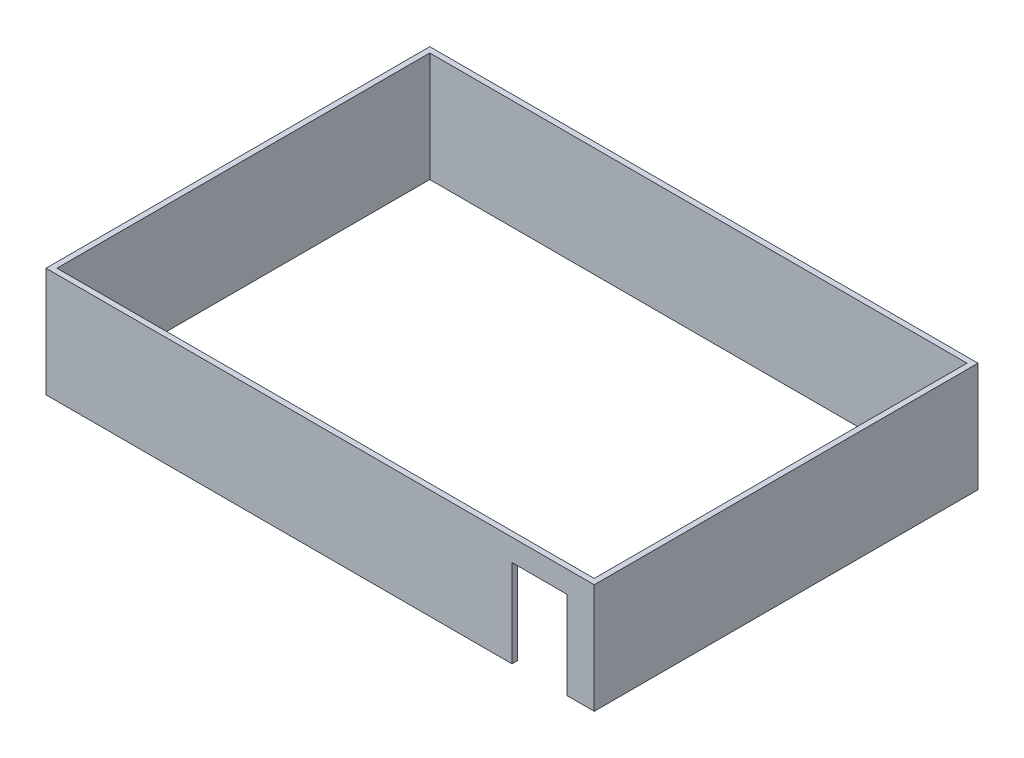
ISO-10303-21;
HEADER;
FILE_DESCRIPTION(('STEP AP214'),'2;1');
FILE_NAME('part.step','',(''),(''),'','','');
FILE_SCHEMA(('AUTOMOTIVE_DESIGN { 1 0 10303 214 1 1 1 1 }'));
ENDSEC;
DATA;
#1=APPLICATION_CONTEXT('core data for automotive mechanical design processes');
#2=APPLICATION_PROTOCOL_DEFINITION('international standard','automotive_design',2000,#1);
#3=PRODUCT_CONTEXT('',#1,'mechanical');
#4=PRODUCT('Part','Part','',(#3));
#5=PRODUCT_RELATED_PRODUCT_CATEGORY('part','',(#4));
#6=PRODUCT_DEFINITION_FORMATION('','',#4);
#7=PRODUCT_DEFINITION_CONTEXT('part definition',#1,'design');
#8=PRODUCT_DEFINITION('design','',#6,#7);
#9=PRODUCT_DEFINITION_SHAPE('','',#8);
#10=(LENGTH_UNIT() NAMED_UNIT(*) SI_UNIT(.MILLI.,.METRE.));
#11=(NAMED_UNIT(*) PLANE_ANGLE_UNIT() SI_UNIT($,.RADIAN.));
#12=(NAMED_UNIT(*) SI_UNIT($,.STERADIAN.) SOLID_ANGLE_UNIT());
#13=UNCERTAINTY_MEASURE_WITH_UNIT(LENGTH_MEASURE(1.E-05),#10,'distance_accuracy_value','');
#14=(GEOMETRIC_REPRESENTATION_CONTEXT(3) GLOBAL_UNCERTAINTY_ASSIGNED_CONTEXT((#13)) GLOBAL_UNIT_ASSIGNED_CONTEXT((#10,
#11,#12)) REPRESENTATION_CONTEXT('',''));
#15=CARTESIAN_POINT('',(0.,0.,0.));
#16=DIRECTION('',(0.,0.,1.));
#17=DIRECTION('',(1.,0.,0.));
#18=AXIS2_PLACEMENT_3D('',#15,#16,#17);
#19=CARTESIAN_POINT('',(0.,200.,0.));
#20=DIRECTION('',(0.,-1.,0.));
#21=DIRECTION('',(0.,0.,-1.));
#22=AXIS2_PLACEMENT_3D('',#19,#20,#21);
#23=PLANE('',#22);
#24=DIRECTION('',(0.,0.,-1.));
#25=VECTOR('',#24,1.);
#26=CARTESIAN_POINT('',(500.,200.,350.));
#27=LINE('',#26,#25);
#28=CARTESIAN_POINT('',(500.,200.,350.));
#29=VERTEX_POINT('',#28);
#30=CARTESIAN_POINT('',(500.,200.,-350.));
#31=VERTEX_POINT('',#30);
#32=EDGE_CURVE('E181',#29,#31,#27,.T.);
#33=ORIENTED_EDGE('',*,*,#32,.T.);
#34=DIRECTION('',(-1.,0.,0.));
#35=VECTOR('',#34,1.);
#36=CARTESIAN_POINT('',(-500.,200.,-350.));
#37=LINE('',#36,#35);
#38=CARTESIAN_POINT('',(-500.,200.,-350.));
#39=VERTEX_POINT('',#38);
#40=EDGE_CURVE('E184',#31,#39,#37,.T.);
#41=ORIENTED_EDGE('',*,*,#40,.T.);
#42=DIRECTION('',(0.,0.,1.));
#43=VECTOR('',#42,1.);
#44=CARTESIAN_POINT('',(-500.,200.,350.));
#45=LINE('',#44,#43);
#46=CARTESIAN_POINT('',(-500.,200.,350.));
#47=VERTEX_POINT('',#46);
#48=EDGE_CURVE('E187',#39,#47,#45,.T.);
#49=ORIENTED_EDGE('',*,*,#48,.T.);
#50=DIRECTION('',(1.,0.,0.));
#51=VECTOR('',#50,1.);
#52=CARTESIAN_POINT('',(-500.,200.,350.));
#53=LINE('',#52,#51);
#54=EDGE_CURVE('E189',#47,#29,#53,.T.);
#55=ORIENTED_EDGE('',*,*,#54,.T.);
#56=EDGE_LOOP('',(#33,#41,#49,#55));
#57=FACE_BOUND('',#56,.T.);
#58=DIRECTION('',(0.,0.,-1.));
#59=VECTOR('',#58,1.);
#60=CARTESIAN_POINT('',(490.,200.,-340.));
#61=LINE('',#60,#59);
#62=CARTESIAN_POINT('',(490.,200.,340.));
#63=VERTEX_POINT('',#62);
#64=CARTESIAN_POINT('',(490.,200.,-340.));
#65=VERTEX_POINT('',#64);
#66=EDGE_CURVE('E151',#63,#65,#61,.T.);
#67=ORIENTED_EDGE('',*,*,#66,.F.);
#68=DIRECTION('',(1.,0.,0.));
#69=VECTOR('',#68,1.);
#70=CARTESIAN_POINT('',(-490.,200.,340.));
#71=LINE('',#70,#69);
#72=CARTESIAN_POINT('',(-490.,200.,340.));
#73=VERTEX_POINT('',#72);
#74=EDGE_CURVE('E158',#73,#63,#71,.T.);
#75=ORIENTED_EDGE('',*,*,#74,.F.);
#76=DIRECTION('',(0.,0.,1.));
#77=VECTOR('',#76,1.);
#78=CARTESIAN_POINT('',(-490.,200.,-340.));
#79=LINE('',#78,#77);
#80=CARTESIAN_POINT('',(-490.,200.,-340.));
#81=VERTEX_POINT('',#80);
#82=EDGE_CURVE('E156',#81,#73,#79,.T.);
#83=ORIENTED_EDGE('',*,*,#82,.F.);
#84=DIRECTION('',(-1.,0.,0.));
#85=VECTOR('',#84,1.);
#86=CARTESIAN_POINT('',(-490.,200.,-340.));
#87=LINE('',#86,#85);
#88=EDGE_CURVE('E153',#65,#81,#87,.T.);
#89=ORIENTED_EDGE('',*,*,#88,.F.);
#90=EDGE_LOOP('',(#67,#75,#83,#89));
#91=FACE_BOUND('',#90,.T.);
#92=ADVANCED_FACE('F34',(#57,#91),#23,.F.);
#93=CARTESIAN_POINT('',(0.,0.,0.));
#94=DIRECTION('',(0.,-1.,0.));
#95=DIRECTION('',(0.,0.,-1.));
#96=AXIS2_PLACEMENT_3D('',#93,#94,#95);
#97=PLANE('',#96);
#98=DIRECTION('',(0.,0.,1.));
#99=VECTOR('',#98,1.);
#100=CARTESIAN_POINT('',(450.,0.,150.));
#101=LINE('',#100,#99);
#102=CARTESIAN_POINT('',(450.,0.,340.));
#103=VERTEX_POINT('',#102);
#104=CARTESIAN_POINT('',(450.,0.,350.));
#105=VERTEX_POINT('',#104);
#106=EDGE_CURVE('E136',#103,#105,#101,.T.);
#107=ORIENTED_EDGE('',*,*,#106,.F.);
#108=DIRECTION('',(1.,0.,0.));
#109=VECTOR('',#108,1.);
#110=CARTESIAN_POINT('',(-490.,0.,340.));
#111=LINE('',#110,#109);
#112=CARTESIAN_POINT('',(490.,0.,340.));
#113=VERTEX_POINT('',#112);
#114=EDGE_CURVE('E169',#103,#113,#111,.T.);
#115=ORIENTED_EDGE('',*,*,#114,.T.);
#116=DIRECTION('',(0.,0.,-1.));
#117=VECTOR('',#116,1.);
#118=CARTESIAN_POINT('',(490.,0.,-340.));
#119=LINE('',#118,#117);
#120=CARTESIAN_POINT('',(490.,0.,-340.));
#121=VERTEX_POINT('',#120);
#122=EDGE_CURVE('E146',#113,#121,#119,.T.);
#123=ORIENTED_EDGE('',*,*,#122,.T.);
#124=DIRECTION('',(-1.,0.,0.));
#125=VECTOR('',#124,1.);
#126=CARTESIAN_POINT('',(-490.,0.,-340.));
#127=LINE('',#126,#125);
#128=CARTESIAN_POINT('',(-490.,0.,-340.));
#129=VERTEX_POINT('',#128);
#130=EDGE_CURVE('E163',#121,#129,#127,.T.);
#131=ORIENTED_EDGE('',*,*,#130,.T.);
#132=DIRECTION('',(0.,0.,1.));
#133=VECTOR('',#132,1.);
#134=CARTESIAN_POINT('',(-490.,0.,-340.));
#135=LINE('',#134,#133);
#136=CARTESIAN_POINT('',(-490.,0.,340.));
#137=VERTEX_POINT('',#136);
#138=EDGE_CURVE('E166',#129,#137,#135,.T.);
#139=ORIENTED_EDGE('',*,*,#138,.T.);
#140=CARTESIAN_POINT('',(350.,0.,340.));
#141=VERTEX_POINT('',#140);
#142=EDGE_CURVE('E154',#137,#141,#111,.T.);
#143=ORIENTED_EDGE('',*,*,#142,.T.);
#144=DIRECTION('',(0.,0.,1.));
#145=VECTOR('',#144,1.);
#146=CARTESIAN_POINT('',(350.,0.,150.));
#147=LINE('',#146,#145);
#148=CARTESIAN_POINT('',(350.,0.,350.));
#149=VERTEX_POINT('',#148);
#150=EDGE_CURVE('E147',#141,#149,#147,.T.);
#151=ORIENTED_EDGE('',*,*,#150,.T.);
#152=DIRECTION('',(1.,0.,0.));
#153=VECTOR('',#152,1.);
#154=CARTESIAN_POINT('',(-500.,0.,350.));
#155=LINE('',#154,#153);
#156=CARTESIAN_POINT('',(-500.,0.,350.));
#157=VERTEX_POINT('',#156);
#158=EDGE_CURVE('E185',#157,#149,#155,.T.);
#159=ORIENTED_EDGE('',*,*,#158,.F.);
#160=DIRECTION('',(0.,0.,1.));
#161=VECTOR('',#160,1.);
#162=CARTESIAN_POINT('',(-500.,0.,350.));
#163=LINE('',#162,#161);
#164=CARTESIAN_POINT('',(-500.,0.,-350.));
#165=VERTEX_POINT('',#164);
#166=EDGE_CURVE('E196',#165,#157,#163,.T.);
#167=ORIENTED_EDGE('',*,*,#166,.F.);
#168=DIRECTION('',(-1.,0.,0.));
#169=VECTOR('',#168,1.);
#170=CARTESIAN_POINT('',(-500.,0.,-350.));
#171=LINE('',#170,#169);
#172=CARTESIAN_POINT('',(500.,0.,-350.));
#173=VERTEX_POINT('',#172);
#174=EDGE_CURVE('E194',#173,#165,#171,.T.);
#175=ORIENTED_EDGE('',*,*,#174,.F.);
#176=DIRECTION('',(0.,0.,-1.));
#177=VECTOR('',#176,1.);
#178=CARTESIAN_POINT('',(500.,0.,350.));
#179=LINE('',#178,#177);
#180=CARTESIAN_POINT('',(500.,0.,350.));
#181=VERTEX_POINT('',#180);
#182=EDGE_CURVE('E180',#181,#173,#179,.T.);
#183=ORIENTED_EDGE('',*,*,#182,.F.);
#184=EDGE_CURVE('E198',#105,#181,#155,.T.);
#185=ORIENTED_EDGE('',*,*,#184,.F.);
#186=EDGE_LOOP('',(#107,#115,#123,#131,#139,#143,#151,#159,#167,#175,#183,#185));
#187=FACE_BOUND('',#186,.T.);
#188=ADVANCED_FACE('F217',(#187),#97,.T.);
#189=CARTESIAN_POINT('',(500.,200.,350.));
#190=DIRECTION('',(-1.,0.,0.));
#191=DIRECTION('',(0.,0.,1.));
#192=AXIS2_PLACEMENT_3D('',#189,#190,#191);
#193=PLANE('',#192);
#194=ORIENTED_EDGE('',*,*,#182,.T.);
#195=DIRECTION('',(0.,-1.,0.));
#196=VECTOR('',#195,1.);
#197=CARTESIAN_POINT('',(500.,200.,-350.));
#198=LINE('',#197,#196);
#199=EDGE_CURVE('E208',#31,#173,#198,.T.);
#200=ORIENTED_EDGE('',*,*,#199,.F.);
#201=ORIENTED_EDGE('',*,*,#32,.F.);
#202=DIRECTION('',(0.,-1.,0.));
#203=VECTOR('',#202,1.);
#204=CARTESIAN_POINT('',(500.,200.,350.));
#205=LINE('',#204,#203);
#206=EDGE_CURVE('E191',#29,#181,#205,.T.);
#207=ORIENTED_EDGE('',*,*,#206,.T.);
#208=EDGE_LOOP('',(#194,#200,#201,#207));
#209=FACE_BOUND('',#208,.T.);
#210=ADVANCED_FACE('F36',(#209),#193,.F.);
#211=CARTESIAN_POINT('',(-500.,200.,-350.));
#212=DIRECTION('',(0.,0.,1.));
#213=DIRECTION('',(1.,0.,0.));
#214=AXIS2_PLACEMENT_3D('',#211,#212,#213);
#215=PLANE('',#214);
#216=ORIENTED_EDGE('',*,*,#174,.T.);
#217=DIRECTION('',(0.,-1.,0.));
#218=VECTOR('',#217,1.);
#219=CARTESIAN_POINT('',(-500.,200.,-350.));
#220=LINE('',#219,#218);
#221=EDGE_CURVE('E205',#39,#165,#220,.T.);
#222=ORIENTED_EDGE('',*,*,#221,.F.);
#223=ORIENTED_EDGE('',*,*,#40,.F.);
#224=ORIENTED_EDGE('',*,*,#199,.T.);
#225=EDGE_LOOP('',(#216,#222,#223,#224));
#226=FACE_BOUND('',#225,.T.);
#227=ADVANCED_FACE('F266',(#226),#215,.F.);
#228=CARTESIAN_POINT('',(-500.,200.,350.));
#229=DIRECTION('',(1.,0.,0.));
#230=DIRECTION('',(0.,0.,-1.));
#231=AXIS2_PLACEMENT_3D('',#228,#229,#230);
#232=PLANE('',#231);
#233=ORIENTED_EDGE('',*,*,#166,.T.);
#234=DIRECTION('',(0.,-1.,0.));
#235=VECTOR('',#234,1.);
#236=CARTESIAN_POINT('',(-500.,200.,350.));
#237=LINE('',#236,#235);
#238=EDGE_CURVE('E202',#47,#157,#237,.T.);
#239=ORIENTED_EDGE('',*,*,#238,.F.);
#240=ORIENTED_EDGE('',*,*,#48,.F.);
#241=ORIENTED_EDGE('',*,*,#221,.T.);
#242=EDGE_LOOP('',(#233,#239,#240,#241));
#243=FACE_BOUND('',#242,.T.);
#244=ADVANCED_FACE('F264',(#243),#232,.F.);
#245=CARTESIAN_POINT('',(-500.,200.,350.));
#246=DIRECTION('',(0.,0.,-1.));
#247=DIRECTION('',(-1.,0.,0.));
#248=AXIS2_PLACEMENT_3D('',#245,#246,#247);
#249=PLANE('',#248);
#250=DIRECTION('',(-1.,0.,0.));
#251=VECTOR('',#250,1.);
#252=CARTESIAN_POINT('',(450.,160.,350.));
#253=LINE('',#252,#251);
#254=CARTESIAN_POINT('',(450.,160.,350.));
#255=VERTEX_POINT('',#254);
#256=CARTESIAN_POINT('',(350.,160.,350.));
#257=VERTEX_POINT('',#256);
#258=EDGE_CURVE('E124',#255,#257,#253,.T.);
#259=ORIENTED_EDGE('',*,*,#258,.F.);
#260=DIRECTION('',(0.,1.,0.));
#261=VECTOR('',#260,1.);
#262=CARTESIAN_POINT('',(450.,0.,350.));
#263=LINE('',#262,#261);
#264=EDGE_CURVE('E133',#105,#255,#263,.T.);
#265=ORIENTED_EDGE('',*,*,#264,.F.);
#266=ORIENTED_EDGE('',*,*,#184,.T.);
#267=ORIENTED_EDGE('',*,*,#206,.F.);
#268=ORIENTED_EDGE('',*,*,#54,.F.);
#269=ORIENTED_EDGE('',*,*,#238,.T.);
#270=ORIENTED_EDGE('',*,*,#158,.T.);
#271=DIRECTION('',(0.,-1.,0.));
#272=VECTOR('',#271,1.);
#273=CARTESIAN_POINT('',(350.,0.,350.));
#274=LINE('',#273,#272);
#275=EDGE_CURVE('E130',#257,#149,#274,.T.);
#276=ORIENTED_EDGE('',*,*,#275,.F.);
#277=EDGE_LOOP('',(#259,#265,#266,#267,#268,#269,#270,#276));
#278=FACE_BOUND('',#277,.T.);
#279=ADVANCED_FACE('F140',(#278),#249,.F.);
#280=CARTESIAN_POINT('',(490.,200.,-340.));
#281=DIRECTION('',(-1.,0.,0.));
#282=DIRECTION('',(0.,0.,1.));
#283=AXIS2_PLACEMENT_3D('',#280,#281,#282);
#284=PLANE('',#283);
#285=ORIENTED_EDGE('',*,*,#122,.F.);
#286=DIRECTION('',(0.,-1.,0.));
#287=VECTOR('',#286,1.);
#288=CARTESIAN_POINT('',(490.,200.,340.));
#289=LINE('',#288,#287);
#290=EDGE_CURVE('E160',#63,#113,#289,.T.);
#291=ORIENTED_EDGE('',*,*,#290,.F.);
#292=ORIENTED_EDGE('',*,*,#66,.T.);
#293=DIRECTION('',(0.,-1.,0.));
#294=VECTOR('',#293,1.);
#295=CARTESIAN_POINT('',(490.,200.,-340.));
#296=LINE('',#295,#294);
#297=EDGE_CURVE('E177',#65,#121,#296,.T.);
#298=ORIENTED_EDGE('',*,*,#297,.T.);
#299=EDGE_LOOP('',(#285,#291,#292,#298));
#300=FACE_BOUND('',#299,.T.);
#301=ADVANCED_FACE('F243',(#300),#284,.T.);
#302=CARTESIAN_POINT('',(-490.,200.,-340.));
#303=DIRECTION('',(0.,0.,1.));
#304=DIRECTION('',(1.,0.,0.));
#305=AXIS2_PLACEMENT_3D('',#302,#303,#304);
#306=PLANE('',#305);
#307=ORIENTED_EDGE('',*,*,#130,.F.);
#308=ORIENTED_EDGE('',*,*,#297,.F.);
#309=ORIENTED_EDGE('',*,*,#88,.T.);
#310=DIRECTION('',(0.,-1.,0.));
#311=VECTOR('',#310,1.);
#312=CARTESIAN_POINT('',(-490.,200.,-340.));
#313=LINE('',#312,#311);
#314=EDGE_CURVE('E175',#81,#129,#313,.T.);
#315=ORIENTED_EDGE('',*,*,#314,.T.);
#316=EDGE_LOOP('',(#307,#308,#309,#315));
#317=FACE_BOUND('',#316,.T.);
#318=ADVANCED_FACE('F246',(#317),#306,.T.);
#319=CARTESIAN_POINT('',(-490.,200.,-340.));
#320=DIRECTION('',(1.,0.,0.));
#321=DIRECTION('',(0.,0.,-1.));
#322=AXIS2_PLACEMENT_3D('',#319,#320,#321);
#323=PLANE('',#322);
#324=ORIENTED_EDGE('',*,*,#138,.F.);
#325=ORIENTED_EDGE('',*,*,#314,.F.);
#326=ORIENTED_EDGE('',*,*,#82,.T.);
#327=DIRECTION('',(0.,-1.,0.));
#328=VECTOR('',#327,1.);
#329=CARTESIAN_POINT('',(-490.,200.,340.));
#330=LINE('',#329,#328);
#331=EDGE_CURVE('E57',#73,#137,#330,.T.);
#332=ORIENTED_EDGE('',*,*,#331,.T.);
#333=EDGE_LOOP('',(#324,#325,#326,#332));
#334=FACE_BOUND('',#333,.T.);
#335=ADVANCED_FACE('F236',(#334),#323,.T.);
#336=CARTESIAN_POINT('',(-490.,200.,340.));
#337=DIRECTION('',(0.,0.,-1.));
#338=DIRECTION('',(-1.,0.,0.));
#339=AXIS2_PLACEMENT_3D('',#336,#337,#338);
#340=PLANE('',#339);
#341=DIRECTION('',(0.,-1.,0.));
#342=VECTOR('',#341,1.);
#343=CARTESIAN_POINT('',(450.,200.,340.));
#344=LINE('',#343,#342);
#345=CARTESIAN_POINT('',(450.,160.,340.));
#346=VERTEX_POINT('',#345);
#347=EDGE_CURVE('E11',#346,#103,#344,.T.);
#348=ORIENTED_EDGE('',*,*,#347,.F.);
#349=DIRECTION('',(1.,0.,0.));
#350=VECTOR('',#349,1.);
#351=CARTESIAN_POINT('',(-490.,160.,340.));
#352=LINE('',#351,#350);
#353=CARTESIAN_POINT('',(350.,160.,340.));
#354=VERTEX_POINT('',#353);
#355=EDGE_CURVE('E127',#354,#346,#352,.T.);
#356=ORIENTED_EDGE('',*,*,#355,.F.);
#357=DIRECTION('',(0.,1.,0.));
#358=VECTOR('',#357,1.);
#359=CARTESIAN_POINT('',(350.,200.,340.));
#360=LINE('',#359,#358);
#361=EDGE_CURVE('E42',#141,#354,#360,.T.);
#362=ORIENTED_EDGE('',*,*,#361,.F.);
#363=ORIENTED_EDGE('',*,*,#142,.F.);
#364=ORIENTED_EDGE('',*,*,#331,.F.);
#365=ORIENTED_EDGE('',*,*,#74,.T.);
#366=ORIENTED_EDGE('',*,*,#290,.T.);
#367=ORIENTED_EDGE('',*,*,#114,.F.);
#368=EDGE_LOOP('',(#348,#356,#362,#363,#364,#365,#366,#367));
#369=FACE_BOUND('',#368,.T.);
#370=ADVANCED_FACE('F214',(#369),#340,.T.);
#371=CARTESIAN_POINT('',(450.,0.,150.));
#372=DIRECTION('',(1.,0.,0.));
#373=DIRECTION('',(0.,1.,0.));
#374=AXIS2_PLACEMENT_3D('',#371,#372,#373);
#375=PLANE('',#374);
#376=ORIENTED_EDGE('',*,*,#347,.T.);
#377=ORIENTED_EDGE('',*,*,#106,.T.);
#378=ORIENTED_EDGE('',*,*,#264,.T.);
#379=DIRECTION('',(0.,0.,1.));
#380=VECTOR('',#379,1.);
#381=CARTESIAN_POINT('',(450.,160.,150.));
#382=LINE('',#381,#380);
#383=EDGE_CURVE('E120',#346,#255,#382,.T.);
#384=ORIENTED_EDGE('',*,*,#383,.F.);
#385=EDGE_LOOP('',(#376,#377,#378,#384));
#386=FACE_BOUND('',#385,.T.);
#387=ADVANCED_FACE('F134',(#386),#375,.F.);
#388=CARTESIAN_POINT('',(350.,0.,150.));
#389=DIRECTION('',(-1.,0.,0.));
#390=DIRECTION('',(0.,0.,1.));
#391=AXIS2_PLACEMENT_3D('',#388,#389,#390);
#392=PLANE('',#391);
#393=ORIENTED_EDGE('',*,*,#361,.T.);
#394=DIRECTION('',(0.,0.,1.));
#395=VECTOR('',#394,1.);
#396=CARTESIAN_POINT('',(350.,160.,150.));
#397=LINE('',#396,#395);
#398=EDGE_CURVE('E49',#354,#257,#397,.T.);
#399=ORIENTED_EDGE('',*,*,#398,.T.);
#400=ORIENTED_EDGE('',*,*,#275,.T.);
#401=ORIENTED_EDGE('',*,*,#150,.F.);
#402=EDGE_LOOP('',(#393,#399,#400,#401));
#403=FACE_BOUND('',#402,.T.);
#404=ADVANCED_FACE('F213',(#403),#392,.F.);
#405=CARTESIAN_POINT('',(450.,160.,150.));
#406=DIRECTION('',(0.,1.,0.));
#407=DIRECTION('',(0.,0.,1.));
#408=AXIS2_PLACEMENT_3D('',#405,#406,#407);
#409=PLANE('',#408);
#410=ORIENTED_EDGE('',*,*,#355,.T.);
#411=ORIENTED_EDGE('',*,*,#383,.T.);
#412=ORIENTED_EDGE('',*,*,#258,.T.);
#413=ORIENTED_EDGE('',*,*,#398,.F.);
#414=EDGE_LOOP('',(#410,#411,#412,#413));
#415=FACE_BOUND('',#414,.T.);
#416=ADVANCED_FACE('F122',(#415),#409,.F.);
#417=CLOSED_SHELL('',(#92,#188,#210,#227,#244,#279,#301,#318,#335,#370,#387,#404,#416));
#418=MANIFOLD_SOLID_BREP('B2',#417);
#419=ADVANCED_BREP_SHAPE_REPRESENTATION('',(#18,#418),#14);
#420=SHAPE_DEFINITION_REPRESENTATION(#9,#419);
ENDSEC;
END-ISO-10303-21;
